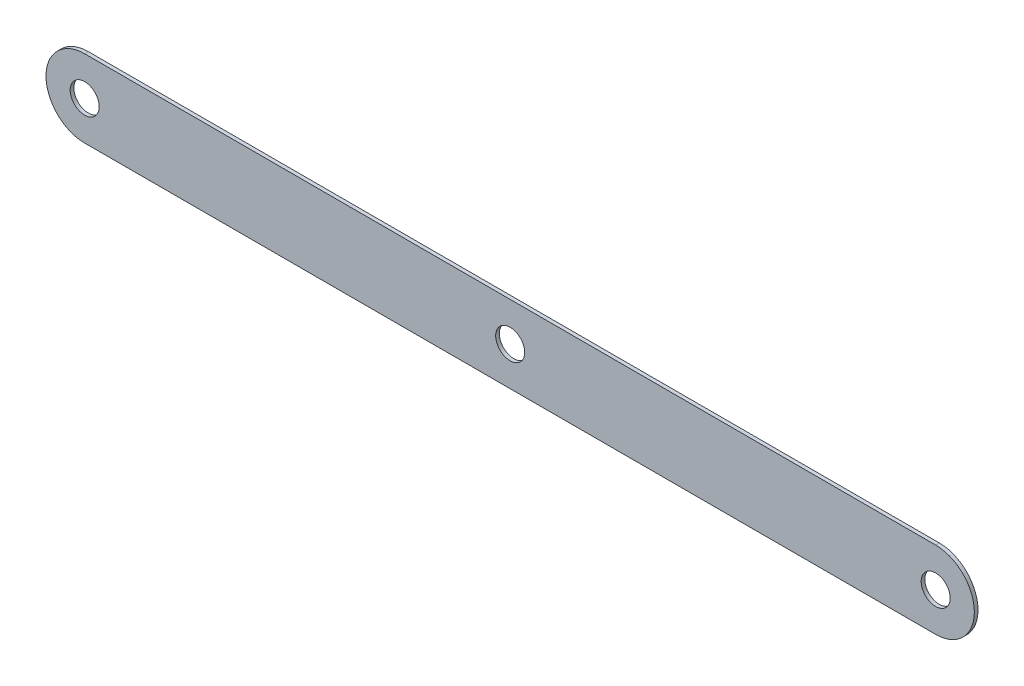
ISO-10303-21;
HEADER;
FILE_DESCRIPTION(('STEP AP214'),'2;1');
FILE_NAME('part.step','',(''),(''),'','','');
FILE_SCHEMA(('AUTOMOTIVE_DESIGN { 1 0 10303 214 1 1 1 1 }'));
ENDSEC;
DATA;
#1=APPLICATION_CONTEXT('core data for automotive mechanical design processes');
#2=APPLICATION_PROTOCOL_DEFINITION('international standard','automotive_design',2000,#1);
#3=PRODUCT_CONTEXT('',#1,'mechanical');
#4=PRODUCT('Part','Part','',(#3));
#5=PRODUCT_RELATED_PRODUCT_CATEGORY('part','',(#4));
#6=PRODUCT_DEFINITION_FORMATION('','',#4);
#7=PRODUCT_DEFINITION_CONTEXT('part definition',#1,'design');
#8=PRODUCT_DEFINITION('design','',#6,#7);
#9=PRODUCT_DEFINITION_SHAPE('','',#8);
#10=(LENGTH_UNIT() NAMED_UNIT(*) SI_UNIT(.MILLI.,.METRE.));
#11=(NAMED_UNIT(*) PLANE_ANGLE_UNIT() SI_UNIT($,.RADIAN.));
#12=(NAMED_UNIT(*) SI_UNIT($,.STERADIAN.) SOLID_ANGLE_UNIT());
#13=UNCERTAINTY_MEASURE_WITH_UNIT(LENGTH_MEASURE(1.E-05),#10,'distance_accuracy_value','');
#14=(GEOMETRIC_REPRESENTATION_CONTEXT(3) GLOBAL_UNCERTAINTY_ASSIGNED_CONTEXT((#13)) GLOBAL_UNIT_ASSIGNED_CONTEXT((#10,
#11,#12)) REPRESENTATION_CONTEXT('',''));
#15=CARTESIAN_POINT('',(0.,0.,0.));
#16=DIRECTION('',(0.,0.,1.));
#17=DIRECTION('',(1.,0.,0.));
#18=AXIS2_PLACEMENT_3D('',#15,#16,#17);
#19=CARTESIAN_POINT('',(0.,-12.7,1.2));
#20=DIRECTION('',(0.,1.,0.));
#21=DIRECTION('',(0.,0.,1.));
#22=AXIS2_PLACEMENT_3D('',#19,#20,#21);
#23=PLANE('',#22);
#24=DIRECTION('',(1.,0.,0.));
#25=VECTOR('',#24,1.);
#26=CARTESIAN_POINT('',(0.,-12.7,0.));
#27=LINE('',#26,#25);
#28=CARTESIAN_POINT('',(-139.7,-12.7,0.));
#29=VERTEX_POINT('',#28);
#30=CARTESIAN_POINT('',(139.7,-12.7,0.));
#31=VERTEX_POINT('',#30);
#32=EDGE_CURVE('E99',#29,#31,#27,.T.);
#33=ORIENTED_EDGE('',*,*,#32,.T.);
#34=DIRECTION('',(0.,0.,-1.));
#35=VECTOR('',#34,1.);
#36=CARTESIAN_POINT('',(139.7,-12.7,1.2));
#37=LINE('',#36,#35);
#38=CARTESIAN_POINT('',(139.7,-12.7,1.2));
#39=VERTEX_POINT('',#38);
#40=EDGE_CURVE('E11',#39,#31,#37,.T.);
#41=ORIENTED_EDGE('',*,*,#40,.F.);
#42=DIRECTION('',(1.,0.,0.));
#43=VECTOR('',#42,1.);
#44=CARTESIAN_POINT('',(0.,-12.7,1.2));
#45=LINE('',#44,#43);
#46=CARTESIAN_POINT('',(-139.7,-12.7,1.2));
#47=VERTEX_POINT('',#46);
#48=EDGE_CURVE('E76',#47,#39,#45,.T.);
#49=ORIENTED_EDGE('',*,*,#48,.F.);
#50=DIRECTION('',(0.,0.,-1.));
#51=VECTOR('',#50,1.);
#52=CARTESIAN_POINT('',(-139.7,-12.7,1.2));
#53=LINE('',#52,#51);
#54=EDGE_CURVE('E95',#47,#29,#53,.T.);
#55=ORIENTED_EDGE('',*,*,#54,.T.);
#56=EDGE_LOOP('',(#33,#41,#49,#55));
#57=FACE_BOUND('',#56,.T.);
#58=ADVANCED_FACE('F37',(#57),#23,.F.);
#59=CARTESIAN_POINT('',(139.7,0.,1.2));
#60=DIRECTION('',(0.,0.,-1.));
#61=DIRECTION('',(-1.,0.,0.));
#62=AXIS2_PLACEMENT_3D('',#59,#60,#61);
#63=CYLINDRICAL_SURFACE('',#62,12.7);
#64=CARTESIAN_POINT('',(139.7,0.,0.));
#65=DIRECTION('',(0.,0.,1.));
#66=DIRECTION('',(1.,0.,0.));
#67=AXIS2_PLACEMENT_3D('',#64,#65,#66);
#68=CIRCLE('',#67,12.7);
#69=CARTESIAN_POINT('',(139.7,12.7,0.));
#70=VERTEX_POINT('',#69);
#71=EDGE_CURVE('E85',#70,#31,#68,.F.);
#72=ORIENTED_EDGE('',*,*,#71,.F.);
#73=DIRECTION('',(0.,0.,-1.));
#74=VECTOR('',#73,1.);
#75=CARTESIAN_POINT('',(139.7,12.7,1.2));
#76=LINE('',#75,#74);
#77=CARTESIAN_POINT('',(139.7,12.7,1.2));
#78=VERTEX_POINT('',#77);
#79=EDGE_CURVE('E45',#78,#70,#76,.T.);
#80=ORIENTED_EDGE('',*,*,#79,.F.);
#81=CARTESIAN_POINT('',(139.7,0.,1.2));
#82=DIRECTION('',(0.,0.,1.));
#83=DIRECTION('',(1.,0.,0.));
#84=AXIS2_PLACEMENT_3D('',#81,#82,#83);
#85=CIRCLE('',#84,12.7);
#86=EDGE_CURVE('E83',#78,#39,#85,.F.);
#87=ORIENTED_EDGE('',*,*,#86,.T.);
#88=ORIENTED_EDGE('',*,*,#40,.T.);
#89=EDGE_LOOP('',(#72,#80,#87,#88));
#90=FACE_BOUND('',#89,.T.);
#91=ADVANCED_FACE('F82',(#90),#63,.T.);
#92=CARTESIAN_POINT('',(0.,12.7,1.2));
#93=DIRECTION('',(0.,1.,0.));
#94=DIRECTION('',(0.,0.,1.));
#95=AXIS2_PLACEMENT_3D('',#92,#93,#94);
#96=PLANE('',#95);
#97=DIRECTION('',(1.,0.,0.));
#98=VECTOR('',#97,1.);
#99=CARTESIAN_POINT('',(0.,12.7,0.));
#100=LINE('',#99,#98);
#101=CARTESIAN_POINT('',(-139.7,12.7,0.));
#102=VERTEX_POINT('',#101);
#103=EDGE_CURVE('E104',#102,#70,#100,.T.);
#104=ORIENTED_EDGE('',*,*,#103,.F.);
#105=DIRECTION('',(0.,0.,-1.));
#106=VECTOR('',#105,1.);
#107=CARTESIAN_POINT('',(-139.7,12.7,1.2));
#108=LINE('',#107,#106);
#109=CARTESIAN_POINT('',(-139.7,12.7,1.2));
#110=VERTEX_POINT('',#109);
#111=EDGE_CURVE('E68',#110,#102,#108,.T.);
#112=ORIENTED_EDGE('',*,*,#111,.F.);
#113=DIRECTION('',(1.,0.,0.));
#114=VECTOR('',#113,1.);
#115=CARTESIAN_POINT('',(0.,12.7,1.2));
#116=LINE('',#115,#114);
#117=EDGE_CURVE('E91',#110,#78,#116,.T.);
#118=ORIENTED_EDGE('',*,*,#117,.T.);
#119=ORIENTED_EDGE('',*,*,#79,.T.);
#120=EDGE_LOOP('',(#104,#112,#118,#119));
#121=FACE_BOUND('',#120,.T.);
#122=ADVANCED_FACE('F93',(#121),#96,.T.);
#123=CARTESIAN_POINT('',(-139.7,0.,1.2));
#124=DIRECTION('',(0.,0.,-1.));
#125=DIRECTION('',(-1.,0.,0.));
#126=AXIS2_PLACEMENT_3D('',#123,#124,#125);
#127=CYLINDRICAL_SURFACE('',#126,12.7);
#128=CARTESIAN_POINT('',(-139.7,0.,0.));
#129=DIRECTION('',(0.,0.,1.));
#130=DIRECTION('',(1.,0.,0.));
#131=AXIS2_PLACEMENT_3D('',#128,#129,#130);
#132=CIRCLE('',#131,12.7);
#133=EDGE_CURVE('E71',#102,#29,#132,.T.);
#134=ORIENTED_EDGE('',*,*,#133,.T.);
#135=ORIENTED_EDGE('',*,*,#54,.F.);
#136=CARTESIAN_POINT('',(-139.7,0.,1.2));
#137=DIRECTION('',(0.,0.,1.));
#138=DIRECTION('',(1.,0.,0.));
#139=AXIS2_PLACEMENT_3D('',#136,#137,#138);
#140=CIRCLE('',#139,12.7);
#141=EDGE_CURVE('E53',#110,#47,#140,.T.);
#142=ORIENTED_EDGE('',*,*,#141,.F.);
#143=ORIENTED_EDGE('',*,*,#111,.T.);
#144=EDGE_LOOP('',(#134,#135,#142,#143));
#145=FACE_BOUND('',#144,.T.);
#146=ADVANCED_FACE('F123',(#145),#127,.T.);
#147=CARTESIAN_POINT('',(0.,0.,1.2));
#148=DIRECTION('',(0.,0.,1.));
#149=DIRECTION('',(1.,0.,0.));
#150=AXIS2_PLACEMENT_3D('',#147,#148,#149);
#151=PLANE('',#150);
#152=CARTESIAN_POINT('',(-139.7,0.,1.2));
#153=DIRECTION('',(0.,0.,1.));
#154=DIRECTION('',(1.,0.,0.));
#155=AXIS2_PLACEMENT_3D('',#152,#153,#154);
#156=CIRCLE('',#155,4.76250000000001);
#157=CARTESIAN_POINT('',(-134.9375,0.,1.2));
#158=VERTEX_POINT('',#157);
#159=EDGE_CURVE('E184',#158,#158,#156,.T.);
#160=ORIENTED_EDGE('',*,*,#159,.F.);
#161=EDGE_LOOP('',(#160));
#162=FACE_BOUND('',#161,.T.);
#163=CARTESIAN_POINT('',(139.7,0.,1.2));
#164=DIRECTION('',(0.,0.,1.));
#165=DIRECTION('',(1.,0.,0.));
#166=AXIS2_PLACEMENT_3D('',#163,#164,#165);
#167=CIRCLE('',#166,4.76250000000001);
#168=CARTESIAN_POINT('',(144.4625,0.,1.2));
#169=VERTEX_POINT('',#168);
#170=EDGE_CURVE('E190',#169,#169,#167,.T.);
#171=ORIENTED_EDGE('',*,*,#170,.F.);
#172=EDGE_LOOP('',(#171));
#173=FACE_BOUND('',#172,.T.);
#174=CARTESIAN_POINT('',(0.,0.,1.2));
#175=DIRECTION('',(0.,0.,1.));
#176=DIRECTION('',(1.,0.,0.));
#177=AXIS2_PLACEMENT_3D('',#174,#175,#176);
#178=CIRCLE('',#177,4.7625);
#179=CARTESIAN_POINT('',(4.7625,0.,1.2));
#180=VERTEX_POINT('',#179);
#181=EDGE_CURVE('E187',#180,#180,#178,.T.);
#182=ORIENTED_EDGE('',*,*,#181,.F.);
#183=EDGE_LOOP('',(#182));
#184=FACE_BOUND('',#183,.T.);
#185=ORIENTED_EDGE('',*,*,#48,.T.);
#186=ORIENTED_EDGE('',*,*,#86,.F.);
#187=ORIENTED_EDGE('',*,*,#117,.F.);
#188=ORIENTED_EDGE('',*,*,#141,.T.);
#189=EDGE_LOOP('',(#185,#186,#187,#188));
#190=FACE_BOUND('',#189,.T.);
#191=ADVANCED_FACE('F90',(#162,#173,#184,#190),#151,.T.);
#192=CARTESIAN_POINT('',(0.,0.,0.));
#193=DIRECTION('',(0.,0.,1.));
#194=DIRECTION('',(1.,0.,0.));
#195=AXIS2_PLACEMENT_3D('',#192,#193,#194);
#196=PLANE('',#195);
#197=CARTESIAN_POINT('',(-139.7,0.,0.));
#198=DIRECTION('',(0.,0.,1.));
#199=DIRECTION('',(1.,0.,0.));
#200=AXIS2_PLACEMENT_3D('',#197,#198,#199);
#201=CIRCLE('',#200,4.76250000000001);
#202=CARTESIAN_POINT('',(-134.9375,0.,0.));
#203=VERTEX_POINT('',#202);
#204=EDGE_CURVE('E181',#203,#203,#201,.T.);
#205=ORIENTED_EDGE('',*,*,#204,.T.);
#206=EDGE_LOOP('',(#205));
#207=FACE_BOUND('',#206,.T.);
#208=CARTESIAN_POINT('',(139.7,0.,0.));
#209=DIRECTION('',(0.,0.,1.));
#210=DIRECTION('',(1.,0.,0.));
#211=AXIS2_PLACEMENT_3D('',#208,#209,#210);
#212=CIRCLE('',#211,4.76250000000001);
#213=CARTESIAN_POINT('',(144.4625,0.,0.));
#214=VERTEX_POINT('',#213);
#215=EDGE_CURVE('E185',#214,#214,#212,.T.);
#216=ORIENTED_EDGE('',*,*,#215,.T.);
#217=EDGE_LOOP('',(#216));
#218=FACE_BOUND('',#217,.T.);
#219=CARTESIAN_POINT('',(0.,0.,0.));
#220=DIRECTION('',(0.,0.,1.));
#221=DIRECTION('',(1.,0.,0.));
#222=AXIS2_PLACEMENT_3D('',#219,#220,#221);
#223=CIRCLE('',#222,4.7625);
#224=CARTESIAN_POINT('',(4.7625,0.,0.));
#225=VERTEX_POINT('',#224);
#226=EDGE_CURVE('E102',#225,#225,#223,.T.);
#227=ORIENTED_EDGE('',*,*,#226,.T.);
#228=EDGE_LOOP('',(#227));
#229=FACE_BOUND('',#228,.T.);
#230=ORIENTED_EDGE('',*,*,#32,.F.);
#231=ORIENTED_EDGE('',*,*,#133,.F.);
#232=ORIENTED_EDGE('',*,*,#103,.T.);
#233=ORIENTED_EDGE('',*,*,#71,.T.);
#234=EDGE_LOOP('',(#230,#231,#232,#233));
#235=FACE_BOUND('',#234,.T.);
#236=ADVANCED_FACE('F111',(#207,#218,#229,#235),#196,.F.);
#237=CARTESIAN_POINT('',(0.,0.,0.));
#238=DIRECTION('',(0.,0.,1.));
#239=DIRECTION('',(1.,0.,0.));
#240=AXIS2_PLACEMENT_3D('',#237,#238,#239);
#241=CYLINDRICAL_SURFACE('',#240,4.7625);
#242=ORIENTED_EDGE('',*,*,#226,.F.);
#243=EDGE_LOOP('',(#242));
#244=FACE_BOUND('',#243,.T.);
#245=ORIENTED_EDGE('',*,*,#181,.T.);
#246=EDGE_LOOP('',(#245));
#247=FACE_BOUND('',#246,.T.);
#248=ADVANCED_FACE('F113',(#244,#247),#241,.F.);
#249=CARTESIAN_POINT('',(139.7,0.,0.));
#250=DIRECTION('',(0.,0.,1.));
#251=DIRECTION('',(1.,0.,0.));
#252=AXIS2_PLACEMENT_3D('',#249,#250,#251);
#253=CYLINDRICAL_SURFACE('',#252,4.76250000000001);
#254=ORIENTED_EDGE('',*,*,#215,.F.);
#255=EDGE_LOOP('',(#254));
#256=FACE_BOUND('',#255,.T.);
#257=ORIENTED_EDGE('',*,*,#170,.T.);
#258=EDGE_LOOP('',(#257));
#259=FACE_BOUND('',#258,.T.);
#260=ADVANCED_FACE('F120',(#256,#259),#253,.F.);
#261=CARTESIAN_POINT('',(-139.7,0.,0.));
#262=DIRECTION('',(0.,0.,1.));
#263=DIRECTION('',(1.,0.,0.));
#264=AXIS2_PLACEMENT_3D('',#261,#262,#263);
#265=CYLINDRICAL_SURFACE('',#264,4.76250000000001);
#266=ORIENTED_EDGE('',*,*,#204,.F.);
#267=EDGE_LOOP('',(#266));
#268=FACE_BOUND('',#267,.T.);
#269=ORIENTED_EDGE('',*,*,#159,.T.);
#270=EDGE_LOOP('',(#269));
#271=FACE_BOUND('',#270,.T.);
#272=ADVANCED_FACE('F165',(#268,#271),#265,.F.);
#273=CLOSED_SHELL('',(#58,#91,#122,#146,#191,#236,#248,#260,#272));
#274=MANIFOLD_SOLID_BREP('B2',#273);
#275=ADVANCED_BREP_SHAPE_REPRESENTATION('',(#18,#274),#14);
#276=SHAPE_DEFINITION_REPRESENTATION(#9,#275);
ENDSEC;
END-ISO-10303-21;
